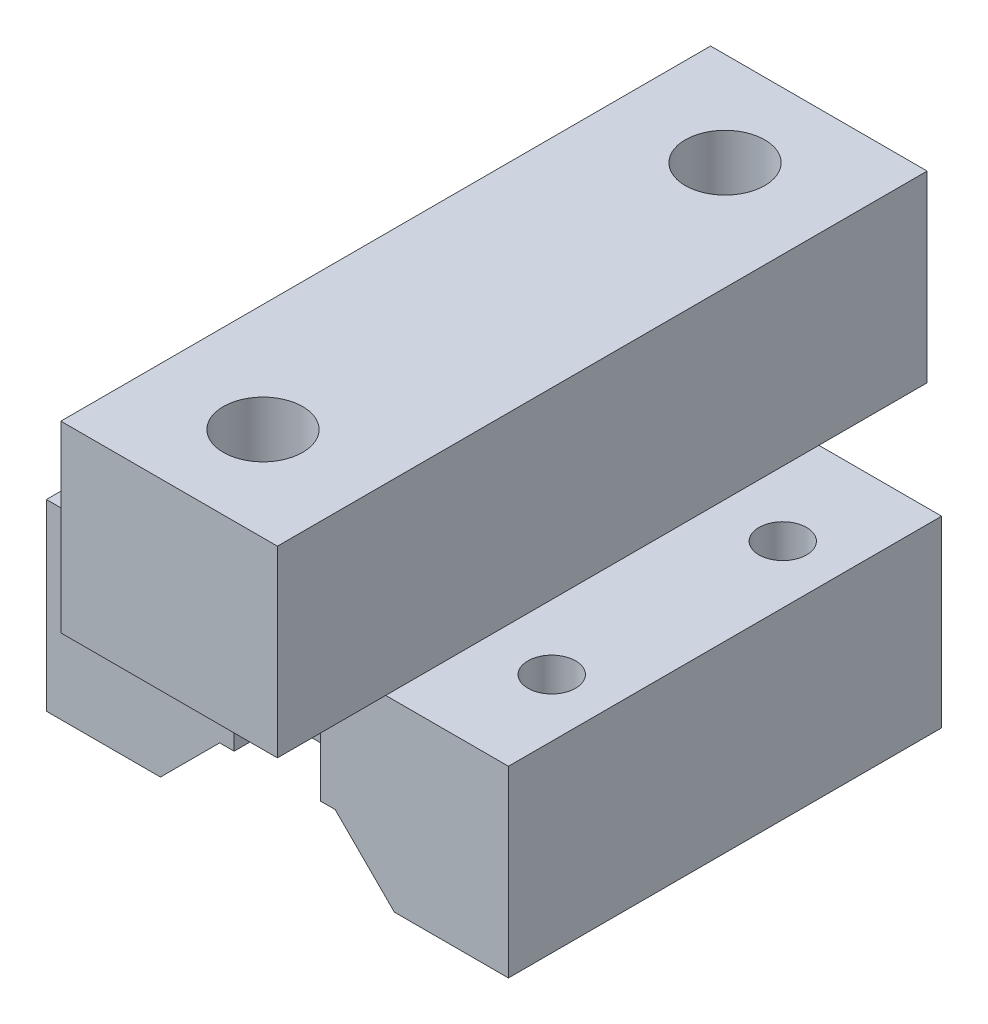
ISO-10303-21;
HEADER;
FILE_DESCRIPTION(('STEP AP214'),'2;1');
FILE_NAME('part.step','',(''),(''),'','','');
FILE_SCHEMA(('AUTOMOTIVE_DESIGN { 1 0 10303 214 1 1 1 1 }'));
ENDSEC;
DATA;
#1=APPLICATION_CONTEXT('core data for automotive mechanical design processes');
#2=APPLICATION_PROTOCOL_DEFINITION('international standard','automotive_design',2000,#1);
#3=PRODUCT_CONTEXT('',#1,'mechanical');
#4=PRODUCT('Part','Part','',(#3));
#5=PRODUCT_RELATED_PRODUCT_CATEGORY('part','',(#4));
#6=PRODUCT_DEFINITION_FORMATION('','',#4);
#7=PRODUCT_DEFINITION_CONTEXT('part definition',#1,'design');
#8=PRODUCT_DEFINITION('design','',#6,#7);
#9=PRODUCT_DEFINITION_SHAPE('','',#8);
#10=(LENGTH_UNIT() NAMED_UNIT(*) SI_UNIT(.MILLI.,.METRE.));
#11=(NAMED_UNIT(*) PLANE_ANGLE_UNIT() SI_UNIT($,.RADIAN.));
#12=(NAMED_UNIT(*) SI_UNIT($,.STERADIAN.) SOLID_ANGLE_UNIT());
#13=UNCERTAINTY_MEASURE_WITH_UNIT(LENGTH_MEASURE(1.E-05),#10,'distance_accuracy_value','');
#14=(GEOMETRIC_REPRESENTATION_CONTEXT(3) GLOBAL_UNCERTAINTY_ASSIGNED_CONTEXT((#13)) GLOBAL_UNIT_ASSIGNED_CONTEXT((#10,
#11,#12)) REPRESENTATION_CONTEXT('',''));
#15=CARTESIAN_POINT('',(0.,0.,0.));
#16=DIRECTION('',(0.,0.,1.));
#17=DIRECTION('',(1.,0.,0.));
#18=AXIS2_PLACEMENT_3D('',#15,#16,#17);
#19=CARTESIAN_POINT('',(-4.,4.10121933088198,15.));
#20=DIRECTION('',(0.,1.,0.));
#21=DIRECTION('',(0.,0.,1.));
#22=AXIS2_PLACEMENT_3D('',#19,#20,#21);
#23=PLANE('',#22);
#24=DIRECTION('',(0.,0.,-1.));
#25=VECTOR('',#24,1.);
#26=CARTESIAN_POINT('',(3.,4.10121933088198,0.));
#27=LINE('',#26,#25);
#28=CARTESIAN_POINT('',(3.,4.10121933088198,15.));
#29=VERTEX_POINT('',#28);
#30=CARTESIAN_POINT('',(3.,4.10121933088198,11.5));
#31=VERTEX_POINT('',#30);
#32=EDGE_CURVE('E253',#29,#31,#27,.T.);
#33=ORIENTED_EDGE('',*,*,#32,.T.);
#34=DIRECTION('',(1.,0.,0.));
#35=VECTOR('',#34,1.);
#36=CARTESIAN_POINT('',(0.,4.10121933088198,11.5));
#37=LINE('',#36,#35);
#38=CARTESIAN_POINT('',(-3.,4.10121933088198,11.5));
#39=VERTEX_POINT('',#38);
#40=EDGE_CURVE('E231',#39,#31,#37,.T.);
#41=ORIENTED_EDGE('',*,*,#40,.F.);
#42=DIRECTION('',(0.,0.,-1.));
#43=VECTOR('',#42,1.);
#44=CARTESIAN_POINT('',(-3.,4.10121933088198,0.));
#45=LINE('',#44,#43);
#46=CARTESIAN_POINT('',(-3.,4.10121933088198,15.));
#47=VERTEX_POINT('',#46);
#48=EDGE_CURVE('E276',#47,#39,#45,.T.);
#49=ORIENTED_EDGE('',*,*,#48,.F.);
#50=DIRECTION('',(1.,0.,0.));
#51=VECTOR('',#50,1.);
#52=CARTESIAN_POINT('',(-4.,4.10121933088198,15.));
#53=LINE('',#52,#51);
#54=CARTESIAN_POINT('',(-4.,4.10121933088198,15.));
#55=VERTEX_POINT('',#54);
#56=EDGE_CURVE('E369',#55,#47,#53,.T.);
#57=ORIENTED_EDGE('',*,*,#56,.F.);
#58=DIRECTION('',(0.,0.,-1.));
#59=VECTOR('',#58,1.);
#60=CARTESIAN_POINT('',(-4.,4.10121933088198,15.));
#61=LINE('',#60,#59);
#62=CARTESIAN_POINT('',(-4.,4.10121933088198,-15.));
#63=VERTEX_POINT('',#62);
#64=EDGE_CURVE('E395',#55,#63,#61,.T.);
#65=ORIENTED_EDGE('',*,*,#64,.T.);
#66=DIRECTION('',(1.,0.,0.));
#67=VECTOR('',#66,1.);
#68=CARTESIAN_POINT('',(-4.,4.10121933088198,-15.));
#69=LINE('',#68,#67);
#70=CARTESIAN_POINT('',(-3.,4.10121933088198,-15.));
#71=VERTEX_POINT('',#70);
#72=EDGE_CURVE('E354',#63,#71,#69,.T.);
#73=ORIENTED_EDGE('',*,*,#72,.T.);
#74=DIRECTION('',(0.,0.,1.));
#75=VECTOR('',#74,1.);
#76=CARTESIAN_POINT('',(-2.99999999999999,4.10121933088198,0.));
#77=LINE('',#76,#75);
#78=CARTESIAN_POINT('',(-3.,4.10121933088198,-11.5));
#79=VERTEX_POINT('',#78);
#80=EDGE_CURVE('E245',#71,#79,#77,.T.);
#81=ORIENTED_EDGE('',*,*,#80,.T.);
#82=DIRECTION('',(1.,0.,0.));
#83=VECTOR('',#82,1.);
#84=CARTESIAN_POINT('',(0.,4.10121933088198,-11.5));
#85=LINE('',#84,#83);
#86=CARTESIAN_POINT('',(3.,4.10121933088198,-11.5));
#87=VERTEX_POINT('',#86);
#88=EDGE_CURVE('E255',#79,#87,#85,.T.);
#89=ORIENTED_EDGE('',*,*,#88,.T.);
#90=DIRECTION('',(0.,0.,1.));
#91=VECTOR('',#90,1.);
#92=CARTESIAN_POINT('',(3.00000000000001,4.10121933088198,0.));
#93=LINE('',#92,#91);
#94=CARTESIAN_POINT('',(2.99999999999999,4.10121933088198,-15.));
#95=VERTEX_POINT('',#94);
#96=EDGE_CURVE('E260',#95,#87,#93,.T.);
#97=ORIENTED_EDGE('',*,*,#96,.F.);
#98=CARTESIAN_POINT('',(4.,4.10121933088198,-15.));
#99=VERTEX_POINT('',#98);
#100=EDGE_CURVE('E390',#95,#99,#69,.T.);
#101=ORIENTED_EDGE('',*,*,#100,.T.);
#102=DIRECTION('',(0.,0.,-1.));
#103=VECTOR('',#102,1.);
#104=CARTESIAN_POINT('',(4.,4.10121933088198,15.));
#105=LINE('',#104,#103);
#106=CARTESIAN_POINT('',(4.,4.10121933088198,15.));
#107=VERTEX_POINT('',#106);
#108=EDGE_CURVE('E372',#107,#99,#105,.T.);
#109=ORIENTED_EDGE('',*,*,#108,.F.);
#110=EDGE_CURVE('E368',#29,#107,#53,.T.);
#111=ORIENTED_EDGE('',*,*,#110,.F.);
#112=EDGE_LOOP('',(#33,#41,#49,#57,#65,#73,#81,#89,#97,#101,#109,#111));
#113=FACE_BOUND('',#112,.T.);
#114=ADVANCED_FACE('F68',(#113),#23,.F.);
#115=CARTESIAN_POINT('',(0.,0.,15.));
#116=DIRECTION('',(0.,0.,-1.));
#117=DIRECTION('',(-1.,0.,0.));
#118=AXIS2_PLACEMENT_3D('',#115,#116,#117);
#119=PLANE('',#118);
#120=DIRECTION('',(0.,1.,0.));
#121=VECTOR('',#120,1.);
#122=CARTESIAN_POINT('',(3.,0.,15.));
#123=LINE('',#122,#121);
#124=CARTESIAN_POINT('',(3.,12.7,15.));
#125=VERTEX_POINT('',#124);
#126=EDGE_CURVE('E241',#29,#125,#123,.T.);
#127=ORIENTED_EDGE('',*,*,#126,.F.);
#128=ORIENTED_EDGE('',*,*,#110,.T.);
#129=DIRECTION('',(0.707106781186546,-0.707106781186549,0.));
#130=VECTOR('',#129,1.);
#131=CARTESIAN_POINT('',(4.,4.10121933088198,15.));
#132=LINE('',#131,#130);
#133=CARTESIAN_POINT('',(8.10121933088197,0.,15.));
#134=VERTEX_POINT('',#133);
#135=EDGE_CURVE('E350',#107,#134,#132,.T.);
#136=ORIENTED_EDGE('',*,*,#135,.T.);
#137=DIRECTION('',(1.,0.,0.));
#138=VECTOR('',#137,1.);
#139=CARTESIAN_POINT('',(8.10121933088197,0.,15.));
#140=LINE('',#139,#138);
#141=CARTESIAN_POINT('',(16.,0.,15.));
#142=VERTEX_POINT('',#141);
#143=EDGE_CURVE('E353',#134,#142,#140,.T.);
#144=ORIENTED_EDGE('',*,*,#143,.T.);
#145=DIRECTION('',(0.,1.,0.));
#146=VECTOR('',#145,1.);
#147=CARTESIAN_POINT('',(16.,0.,15.));
#148=LINE('',#147,#146);
#149=CARTESIAN_POINT('',(16.,12.7,15.));
#150=VERTEX_POINT('',#149);
#151=EDGE_CURVE('E356',#142,#150,#148,.T.);
#152=ORIENTED_EDGE('',*,*,#151,.T.);
#153=DIRECTION('',(-1.,0.,0.));
#154=VECTOR('',#153,1.);
#155=CARTESIAN_POINT('',(16.,12.7,15.));
#156=LINE('',#155,#154);
#157=CARTESIAN_POINT('',(7.49999999999999,12.7,15.));
#158=VERTEX_POINT('',#157);
#159=EDGE_CURVE('E359',#150,#158,#156,.T.);
#160=ORIENTED_EDGE('',*,*,#159,.T.);
#161=EDGE_CURVE('E362',#158,#125,#156,.T.);
#162=ORIENTED_EDGE('',*,*,#161,.T.);
#163=EDGE_LOOP('',(#127,#128,#136,#144,#152,#160,#162));
#164=FACE_BOUND('',#163,.T.);
#165=ADVANCED_FACE('F433',(#164),#119,.F.);
#166=CARTESIAN_POINT('',(0.,0.,-15.));
#167=DIRECTION('',(0.,0.,-1.));
#168=DIRECTION('',(-1.,0.,0.));
#169=AXIS2_PLACEMENT_3D('',#166,#167,#168);
#170=PLANE('',#169);
#171=DIRECTION('',(-1.,0.,0.));
#172=VECTOR('',#171,1.);
#173=CARTESIAN_POINT('',(16.,12.7,-15.));
#174=LINE('',#173,#172);
#175=CARTESIAN_POINT('',(-3.,12.7,-15.));
#176=VERTEX_POINT('',#175);
#177=CARTESIAN_POINT('',(-7.50000000000001,12.7,-15.));
#178=VERTEX_POINT('',#177);
#179=EDGE_CURVE('E384',#176,#178,#174,.T.);
#180=ORIENTED_EDGE('',*,*,#179,.F.);
#181=DIRECTION('',(0.,-1.,0.));
#182=VECTOR('',#181,1.);
#183=CARTESIAN_POINT('',(-3.,0.,-15.));
#184=LINE('',#183,#182);
#185=EDGE_CURVE('E280',#176,#71,#184,.T.);
#186=ORIENTED_EDGE('',*,*,#185,.T.);
#187=ORIENTED_EDGE('',*,*,#72,.F.);
#188=DIRECTION('',(0.707106781186546,0.707106781186549,0.));
#189=VECTOR('',#188,1.);
#190=CARTESIAN_POINT('',(-4.,4.10121933088198,-15.));
#191=LINE('',#190,#189);
#192=CARTESIAN_POINT('',(-8.10121933088197,0.,-15.));
#193=VERTEX_POINT('',#192);
#194=EDGE_CURVE('E388',#193,#63,#191,.T.);
#195=ORIENTED_EDGE('',*,*,#194,.F.);
#196=DIRECTION('',(1.,0.,0.));
#197=VECTOR('',#196,1.);
#198=CARTESIAN_POINT('',(-8.10121933088197,0.,-15.));
#199=LINE('',#198,#197);
#200=CARTESIAN_POINT('',(-16.,0.,-15.));
#201=VERTEX_POINT('',#200);
#202=EDGE_CURVE('E386',#201,#193,#199,.T.);
#203=ORIENTED_EDGE('',*,*,#202,.F.);
#204=DIRECTION('',(0.,-1.,0.));
#205=VECTOR('',#204,1.);
#206=CARTESIAN_POINT('',(-16.,0.,-15.));
#207=LINE('',#206,#205);
#208=CARTESIAN_POINT('',(-16.,12.7,-15.));
#209=VERTEX_POINT('',#208);
#210=EDGE_CURVE('E382',#209,#201,#207,.T.);
#211=ORIENTED_EDGE('',*,*,#210,.F.);
#212=EDGE_CURVE('E379',#178,#209,#174,.T.);
#213=ORIENTED_EDGE('',*,*,#212,.F.);
#214=EDGE_LOOP('',(#180,#186,#187,#195,#203,#211,#213));
#215=FACE_BOUND('',#214,.T.);
#216=ADVANCED_FACE('F457',(#215),#170,.T.);
#217=CARTESIAN_POINT('',(16.,12.7,15.));
#218=DIRECTION('',(0.,-1.,0.));
#219=DIRECTION('',(1.,0.,0.));
#220=AXIS2_PLACEMENT_3D('',#217,#218,#219);
#221=PLANE('',#220);
#222=CARTESIAN_POINT('',(12.,12.7,8.));
#223=DIRECTION('',(0.,1.,0.));
#224=DIRECTION('',(0.,0.,1.));
#225=AXIS2_PLACEMENT_3D('',#222,#223,#224);
#226=CIRCLE('',#225,1.65);
#227=CARTESIAN_POINT('',(12.,12.7,9.65));
#228=VERTEX_POINT('',#227);
#229=EDGE_CURVE('E326',#228,#228,#226,.T.);
#230=ORIENTED_EDGE('',*,*,#229,.F.);
#231=EDGE_LOOP('',(#230));
#232=FACE_BOUND('',#231,.T.);
#233=CARTESIAN_POINT('',(12.,12.7,-8.));
#234=DIRECTION('',(0.,1.,0.));
#235=DIRECTION('',(0.,0.,1.));
#236=AXIS2_PLACEMENT_3D('',#233,#234,#235);
#237=CIRCLE('',#236,1.65);
#238=CARTESIAN_POINT('',(12.,12.7,-6.35));
#239=VERTEX_POINT('',#238);
#240=EDGE_CURVE('E333',#239,#239,#237,.T.);
#241=ORIENTED_EDGE('',*,*,#240,.F.);
#242=EDGE_LOOP('',(#241));
#243=FACE_BOUND('',#242,.T.);
#244=DIRECTION('',(0.,0.,-1.));
#245=VECTOR('',#244,1.);
#246=CARTESIAN_POINT('',(7.49999999999999,12.7,0.));
#247=LINE('',#246,#245);
#248=CARTESIAN_POINT('',(7.49999999999999,12.7,-15.));
#249=VERTEX_POINT('',#248);
#250=EDGE_CURVE('E77',#158,#249,#247,.T.);
#251=ORIENTED_EDGE('',*,*,#250,.F.);
#252=ORIENTED_EDGE('',*,*,#159,.F.);
#253=DIRECTION('',(0.,0.,-1.));
#254=VECTOR('',#253,1.);
#255=CARTESIAN_POINT('',(16.,12.7,15.));
#256=LINE('',#255,#254);
#257=CARTESIAN_POINT('',(16.,12.7,-15.));
#258=VERTEX_POINT('',#257);
#259=EDGE_CURVE('E407',#150,#258,#256,.T.);
#260=ORIENTED_EDGE('',*,*,#259,.T.);
#261=EDGE_CURVE('E380',#258,#249,#174,.T.);
#262=ORIENTED_EDGE('',*,*,#261,.T.);
#263=EDGE_LOOP('',(#251,#252,#260,#262));
#264=FACE_BOUND('',#263,.T.);
#265=ADVANCED_FACE('F430',(#232,#243,#264),#221,.F.);
#266=CARTESIAN_POINT('',(-12.,12.7,8.));
#267=DIRECTION('',(0.,1.,0.));
#268=DIRECTION('',(0.,0.,1.));
#269=AXIS2_PLACEMENT_3D('',#266,#267,#268);
#270=CIRCLE('',#269,1.65);
#271=CARTESIAN_POINT('',(-12.,12.7,9.65));
#272=VERTEX_POINT('',#271);
#273=EDGE_CURVE('E334',#272,#272,#270,.T.);
#274=ORIENTED_EDGE('',*,*,#273,.F.);
#275=EDGE_LOOP('',(#274));
#276=FACE_BOUND('',#275,.T.);
#277=CARTESIAN_POINT('',(-12.,12.7,-8.));
#278=DIRECTION('',(0.,1.,0.));
#279=DIRECTION('',(0.,0.,1.));
#280=AXIS2_PLACEMENT_3D('',#277,#278,#279);
#281=CIRCLE('',#280,1.65);
#282=CARTESIAN_POINT('',(-12.,12.7,-6.35));
#283=VERTEX_POINT('',#282);
#284=EDGE_CURVE('E325',#283,#283,#281,.T.);
#285=ORIENTED_EDGE('',*,*,#284,.F.);
#286=EDGE_LOOP('',(#285));
#287=FACE_BOUND('',#286,.T.);
#288=CARTESIAN_POINT('',(-7.50000000000001,12.7,15.));
#289=VERTEX_POINT('',#288);
#290=CARTESIAN_POINT('',(-16.,12.7,15.));
#291=VERTEX_POINT('',#290);
#292=EDGE_CURVE('E358',#289,#291,#156,.T.);
#293=ORIENTED_EDGE('',*,*,#292,.F.);
#294=DIRECTION('',(0.,0.,-1.));
#295=VECTOR('',#294,1.);
#296=CARTESIAN_POINT('',(-7.50000000000001,12.7,0.));
#297=LINE('',#296,#295);
#298=EDGE_CURVE('E12',#289,#178,#297,.T.);
#299=ORIENTED_EDGE('',*,*,#298,.T.);
#300=ORIENTED_EDGE('',*,*,#212,.T.);
#301=DIRECTION('',(0.,0.,-1.));
#302=VECTOR('',#301,1.);
#303=CARTESIAN_POINT('',(-16.,12.7,15.));
#304=LINE('',#303,#302);
#305=EDGE_CURVE('E404',#291,#209,#304,.T.);
#306=ORIENTED_EDGE('',*,*,#305,.F.);
#307=EDGE_LOOP('',(#293,#299,#300,#306));
#308=FACE_BOUND('',#307,.T.);
#309=ADVANCED_FACE('F452',(#276,#287,#308),#221,.F.);
#310=CARTESIAN_POINT('',(4.,4.10121933088198,15.));
#311=DIRECTION('',(0.707106781186549,0.707106781186546,0.));
#312=DIRECTION('',(-0.707106781186546,0.707106781186549,0.));
#313=AXIS2_PLACEMENT_3D('',#310,#311,#312);
#314=PLANE('',#313);
#315=DIRECTION('',(0.707106781186546,-0.707106781186549,0.));
#316=VECTOR('',#315,1.);
#317=CARTESIAN_POINT('',(4.,4.10121933088198,-15.));
#318=LINE('',#317,#316);
#319=CARTESIAN_POINT('',(8.10121933088197,0.,-15.));
#320=VERTEX_POINT('',#319);
#321=EDGE_CURVE('E349',#99,#320,#318,.T.);
#322=ORIENTED_EDGE('',*,*,#321,.T.);
#323=DIRECTION('',(0.,0.,-1.));
#324=VECTOR('',#323,1.);
#325=CARTESIAN_POINT('',(8.10121933088197,0.,15.));
#326=LINE('',#325,#324);
#327=EDGE_CURVE('E72',#134,#320,#326,.T.);
#328=ORIENTED_EDGE('',*,*,#327,.F.);
#329=ORIENTED_EDGE('',*,*,#135,.F.);
#330=ORIENTED_EDGE('',*,*,#108,.T.);
#331=EDGE_LOOP('',(#322,#328,#329,#330));
#332=FACE_BOUND('',#331,.T.);
#333=ADVANCED_FACE('F70',(#332),#314,.F.);
#334=CARTESIAN_POINT('',(8.10121933088197,0.,15.));
#335=DIRECTION('',(0.,1.,0.));
#336=DIRECTION('',(-1.,0.,0.));
#337=AXIS2_PLACEMENT_3D('',#334,#335,#336);
#338=PLANE('',#337);
#339=CARTESIAN_POINT('',(12.,0.,8.));
#340=DIRECTION('',(0.,1.,0.));
#341=DIRECTION('',(-1.,0.,0.));
#342=AXIS2_PLACEMENT_3D('',#339,#340,#341);
#343=CIRCLE('',#342,1.65);
#344=CARTESIAN_POINT('',(10.35,0.,8.));
#345=VERTEX_POINT('',#344);
#346=EDGE_CURVE('E329',#345,#345,#343,.F.);
#347=ORIENTED_EDGE('',*,*,#346,.F.);
#348=EDGE_LOOP('',(#347));
#349=FACE_BOUND('',#348,.T.);
#350=CARTESIAN_POINT('',(12.,0.,-8.));
#351=DIRECTION('',(0.,1.,0.));
#352=DIRECTION('',(-1.,0.,0.));
#353=AXIS2_PLACEMENT_3D('',#350,#351,#352);
#354=CIRCLE('',#353,1.65);
#355=CARTESIAN_POINT('',(10.35,0.,-8.));
#356=VERTEX_POINT('',#355);
#357=EDGE_CURVE('E346',#356,#356,#354,.F.);
#358=ORIENTED_EDGE('',*,*,#357,.F.);
#359=EDGE_LOOP('',(#358));
#360=FACE_BOUND('',#359,.T.);
#361=DIRECTION('',(1.,0.,0.));
#362=VECTOR('',#361,1.);
#363=CARTESIAN_POINT('',(8.10121933088197,0.,-15.));
#364=LINE('',#363,#362);
#365=CARTESIAN_POINT('',(16.,0.,-15.));
#366=VERTEX_POINT('',#365);
#367=EDGE_CURVE('E375',#320,#366,#364,.T.);
#368=ORIENTED_EDGE('',*,*,#367,.T.);
#369=DIRECTION('',(0.,0.,-1.));
#370=VECTOR('',#369,1.);
#371=CARTESIAN_POINT('',(16.,0.,15.));
#372=LINE('',#371,#370);
#373=EDGE_CURVE('E409',#142,#366,#372,.T.);
#374=ORIENTED_EDGE('',*,*,#373,.F.);
#375=ORIENTED_EDGE('',*,*,#143,.F.);
#376=ORIENTED_EDGE('',*,*,#327,.T.);
#377=EDGE_LOOP('',(#368,#374,#375,#376));
#378=FACE_BOUND('',#377,.T.);
#379=ADVANCED_FACE('F418',(#349,#360,#378),#338,.F.);
#380=CARTESIAN_POINT('',(16.,0.,15.));
#381=DIRECTION('',(-1.,0.,0.));
#382=DIRECTION('',(0.,-1.,0.));
#383=AXIS2_PLACEMENT_3D('',#380,#381,#382);
#384=PLANE('',#383);
#385=DIRECTION('',(0.,1.,0.));
#386=VECTOR('',#385,1.);
#387=CARTESIAN_POINT('',(16.,0.,-15.));
#388=LINE('',#387,#386);
#389=EDGE_CURVE('E377',#366,#258,#388,.T.);
#390=ORIENTED_EDGE('',*,*,#389,.T.);
#391=ORIENTED_EDGE('',*,*,#259,.F.);
#392=ORIENTED_EDGE('',*,*,#151,.F.);
#393=ORIENTED_EDGE('',*,*,#373,.T.);
#394=EDGE_LOOP('',(#390,#391,#392,#393));
#395=FACE_BOUND('',#394,.T.);
#396=ADVANCED_FACE('F429',(#395),#384,.F.);
#397=CARTESIAN_POINT('',(-16.,0.,15.));
#398=DIRECTION('',(1.,0.,0.));
#399=DIRECTION('',(0.,1.,0.));
#400=AXIS2_PLACEMENT_3D('',#397,#398,#399);
#401=PLANE('',#400);
#402=ORIENTED_EDGE('',*,*,#210,.T.);
#403=DIRECTION('',(0.,0.,-1.));
#404=VECTOR('',#403,1.);
#405=CARTESIAN_POINT('',(-16.,0.,15.));
#406=LINE('',#405,#404);
#407=CARTESIAN_POINT('',(-16.,0.,15.));
#408=VERTEX_POINT('',#407);
#409=EDGE_CURVE('E401',#408,#201,#406,.T.);
#410=ORIENTED_EDGE('',*,*,#409,.F.);
#411=DIRECTION('',(0.,-1.,0.));
#412=VECTOR('',#411,1.);
#413=CARTESIAN_POINT('',(-16.,0.,15.));
#414=LINE('',#413,#412);
#415=EDGE_CURVE('E361',#291,#408,#414,.T.);
#416=ORIENTED_EDGE('',*,*,#415,.F.);
#417=ORIENTED_EDGE('',*,*,#305,.T.);
#418=EDGE_LOOP('',(#402,#410,#416,#417));
#419=FACE_BOUND('',#418,.T.);
#420=ADVANCED_FACE('F523',(#419),#401,.F.);
#421=CARTESIAN_POINT('',(-8.10121933088197,0.,15.));
#422=DIRECTION('',(0.,1.,0.));
#423=DIRECTION('',(-1.,0.,0.));
#424=AXIS2_PLACEMENT_3D('',#421,#422,#423);
#425=PLANE('',#424);
#426=CARTESIAN_POINT('',(-12.,0.,-8.));
#427=DIRECTION('',(0.,1.,0.));
#428=DIRECTION('',(-1.,0.,0.));
#429=AXIS2_PLACEMENT_3D('',#426,#427,#428);
#430=CIRCLE('',#429,1.65);
#431=CARTESIAN_POINT('',(-13.65,0.,-8.));
#432=VERTEX_POINT('',#431);
#433=EDGE_CURVE('E337',#432,#432,#430,.F.);
#434=ORIENTED_EDGE('',*,*,#433,.F.);
#435=EDGE_LOOP('',(#434));
#436=FACE_BOUND('',#435,.T.);
#437=CARTESIAN_POINT('',(-12.,0.,8.));
#438=DIRECTION('',(0.,1.,0.));
#439=DIRECTION('',(-1.,0.,0.));
#440=AXIS2_PLACEMENT_3D('',#437,#438,#439);
#441=CIRCLE('',#440,1.65);
#442=CARTESIAN_POINT('',(-13.65,0.,8.));
#443=VERTEX_POINT('',#442);
#444=EDGE_CURVE('E330',#443,#443,#441,.F.);
#445=ORIENTED_EDGE('',*,*,#444,.F.);
#446=EDGE_LOOP('',(#445));
#447=FACE_BOUND('',#446,.T.);
#448=ORIENTED_EDGE('',*,*,#202,.T.);
#449=DIRECTION('',(0.,0.,-1.));
#450=VECTOR('',#449,1.);
#451=CARTESIAN_POINT('',(-8.10121933088197,0.,15.));
#452=LINE('',#451,#450);
#453=CARTESIAN_POINT('',(-8.10121933088197,0.,15.));
#454=VERTEX_POINT('',#453);
#455=EDGE_CURVE('E398',#454,#193,#452,.T.);
#456=ORIENTED_EDGE('',*,*,#455,.F.);
#457=DIRECTION('',(1.,0.,0.));
#458=VECTOR('',#457,1.);
#459=CARTESIAN_POINT('',(-8.10121933088197,0.,15.));
#460=LINE('',#459,#458);
#461=EDGE_CURVE('E364',#408,#454,#460,.T.);
#462=ORIENTED_EDGE('',*,*,#461,.F.);
#463=ORIENTED_EDGE('',*,*,#409,.T.);
#464=EDGE_LOOP('',(#448,#456,#462,#463));
#465=FACE_BOUND('',#464,.T.);
#466=ADVANCED_FACE('F519',(#436,#447,#465),#425,.F.);
#467=CARTESIAN_POINT('',(-4.,4.10121933088198,15.));
#468=DIRECTION('',(-0.707106781186549,0.707106781186546,0.));
#469=DIRECTION('',(-0.707106781186546,-0.707106781186549,0.));
#470=AXIS2_PLACEMENT_3D('',#467,#468,#469);
#471=PLANE('',#470);
#472=ORIENTED_EDGE('',*,*,#194,.T.);
#473=ORIENTED_EDGE('',*,*,#64,.F.);
#474=DIRECTION('',(0.707106781186546,0.707106781186549,0.));
#475=VECTOR('',#474,1.);
#476=CARTESIAN_POINT('',(-4.,4.10121933088198,15.));
#477=LINE('',#476,#475);
#478=EDGE_CURVE('E366',#454,#55,#477,.T.);
#479=ORIENTED_EDGE('',*,*,#478,.F.);
#480=ORIENTED_EDGE('',*,*,#455,.T.);
#481=EDGE_LOOP('',(#472,#473,#479,#480));
#482=FACE_BOUND('',#481,.T.);
#483=ADVANCED_FACE('F516',(#482),#471,.F.);
#484=ORIENTED_EDGE('',*,*,#56,.T.);
#485=DIRECTION('',(0.,1.,0.));
#486=VECTOR('',#485,1.);
#487=CARTESIAN_POINT('',(-3.,0.,15.));
#488=LINE('',#487,#486);
#489=CARTESIAN_POINT('',(-3.,12.7,15.));
#490=VERTEX_POINT('',#489);
#491=EDGE_CURVE('E274',#47,#490,#488,.T.);
#492=ORIENTED_EDGE('',*,*,#491,.T.);
#493=EDGE_CURVE('E87',#490,#289,#156,.T.);
#494=ORIENTED_EDGE('',*,*,#493,.T.);
#495=ORIENTED_EDGE('',*,*,#292,.T.);
#496=ORIENTED_EDGE('',*,*,#415,.T.);
#497=ORIENTED_EDGE('',*,*,#461,.T.);
#498=ORIENTED_EDGE('',*,*,#478,.T.);
#499=EDGE_LOOP('',(#484,#492,#494,#495,#496,#497,#498));
#500=FACE_BOUND('',#499,.T.);
#501=ADVANCED_FACE('F513',(#500),#119,.F.);
#502=DIRECTION('',(0.,-1.,0.));
#503=VECTOR('',#502,1.);
#504=CARTESIAN_POINT('',(2.99999999999999,0.,-15.));
#505=LINE('',#504,#503);
#506=CARTESIAN_POINT('',(2.99999999999999,12.7,-15.));
#507=VERTEX_POINT('',#506);
#508=EDGE_CURVE('E278',#507,#95,#505,.T.);
#509=ORIENTED_EDGE('',*,*,#508,.F.);
#510=EDGE_CURVE('E383',#249,#507,#174,.T.);
#511=ORIENTED_EDGE('',*,*,#510,.F.);
#512=ORIENTED_EDGE('',*,*,#261,.F.);
#513=ORIENTED_EDGE('',*,*,#389,.F.);
#514=ORIENTED_EDGE('',*,*,#367,.F.);
#515=ORIENTED_EDGE('',*,*,#321,.F.);
#516=ORIENTED_EDGE('',*,*,#100,.F.);
#517=EDGE_LOOP('',(#509,#511,#512,#513,#514,#515,#516));
#518=FACE_BOUND('',#517,.T.);
#519=ADVANCED_FACE('F426',(#518),#170,.T.);
#520=CARTESIAN_POINT('',(-12.,-4.66690475583122,8.));
#521=DIRECTION('',(0.,1.,0.));
#522=DIRECTION('',(0.,0.,1.));
#523=AXIS2_PLACEMENT_3D('',#520,#521,#522);
#524=CYLINDRICAL_SURFACE('',#523,1.65);
#525=ORIENTED_EDGE('',*,*,#444,.T.);
#526=EDGE_LOOP('',(#525));
#527=FACE_BOUND('',#526,.T.);
#528=ORIENTED_EDGE('',*,*,#273,.T.);
#529=EDGE_LOOP('',(#528));
#530=FACE_BOUND('',#529,.T.);
#531=ADVANCED_FACE('F550',(#527,#530),#524,.F.);
#532=CARTESIAN_POINT('',(-12.,-4.66690475583122,-8.));
#533=DIRECTION('',(0.,1.,0.));
#534=DIRECTION('',(0.,0.,1.));
#535=AXIS2_PLACEMENT_3D('',#532,#533,#534);
#536=CYLINDRICAL_SURFACE('',#535,1.65);
#537=ORIENTED_EDGE('',*,*,#433,.T.);
#538=EDGE_LOOP('',(#537));
#539=FACE_BOUND('',#538,.T.);
#540=ORIENTED_EDGE('',*,*,#284,.T.);
#541=EDGE_LOOP('',(#540));
#542=FACE_BOUND('',#541,.T.);
#543=ADVANCED_FACE('F543',(#539,#542),#536,.F.);
#544=CARTESIAN_POINT('',(12.,-4.66690475583122,-8.));
#545=DIRECTION('',(0.,1.,0.));
#546=DIRECTION('',(0.,0.,1.));
#547=AXIS2_PLACEMENT_3D('',#544,#545,#546);
#548=CYLINDRICAL_SURFACE('',#547,1.65);
#549=ORIENTED_EDGE('',*,*,#357,.T.);
#550=EDGE_LOOP('',(#549));
#551=FACE_BOUND('',#550,.T.);
#552=ORIENTED_EDGE('',*,*,#240,.T.);
#553=EDGE_LOOP('',(#552));
#554=FACE_BOUND('',#553,.T.);
#555=ADVANCED_FACE('F503',(#551,#554),#548,.F.);
#556=CARTESIAN_POINT('',(12.,-4.66690475583122,8.));
#557=DIRECTION('',(0.,1.,0.));
#558=DIRECTION('',(0.,0.,1.));
#559=AXIS2_PLACEMENT_3D('',#556,#557,#558);
#560=CYLINDRICAL_SURFACE('',#559,1.65);
#561=ORIENTED_EDGE('',*,*,#346,.T.);
#562=EDGE_LOOP('',(#561));
#563=FACE_BOUND('',#562,.T.);
#564=ORIENTED_EDGE('',*,*,#229,.T.);
#565=EDGE_LOOP('',(#564));
#566=FACE_BOUND('',#565,.T.);
#567=ADVANCED_FACE('F496',(#563,#566),#560,.F.);
#568=CARTESIAN_POINT('',(0.,12.7,0.));
#569=DIRECTION('',(0.,1.,0.));
#570=DIRECTION('',(0.,0.,1.));
#571=AXIS2_PLACEMENT_3D('',#568,#569,#570);
#572=PLANE('',#571);
#573=DIRECTION('',(0.,0.,-1.));
#574=VECTOR('',#573,1.);
#575=CARTESIAN_POINT('',(-2.99999999999999,12.7,0.));
#576=LINE('',#575,#574);
#577=CARTESIAN_POINT('',(-3.,12.7,-11.5));
#578=VERTEX_POINT('',#577);
#579=EDGE_CURVE('E258',#578,#176,#576,.T.);
#580=ORIENTED_EDGE('',*,*,#579,.T.);
#581=ORIENTED_EDGE('',*,*,#179,.T.);
#582=CARTESIAN_POINT('',(-7.50000000000001,12.7,-22.5));
#583=VERTEX_POINT('',#582);
#584=EDGE_CURVE('E80',#178,#583,#297,.T.);
#585=ORIENTED_EDGE('',*,*,#584,.T.);
#586=DIRECTION('',(-1.,0.,0.));
#587=VECTOR('',#586,1.);
#588=CARTESIAN_POINT('',(0.,12.7,-22.5));
#589=LINE('',#588,#587);
#590=CARTESIAN_POINT('',(7.49999999999999,12.7,-22.5));
#591=VERTEX_POINT('',#590);
#592=EDGE_CURVE('E308',#591,#583,#589,.T.);
#593=ORIENTED_EDGE('',*,*,#592,.F.);
#594=EDGE_CURVE('E304',#249,#591,#247,.T.);
#595=ORIENTED_EDGE('',*,*,#594,.F.);
#596=ORIENTED_EDGE('',*,*,#510,.T.);
#597=DIRECTION('',(0.,0.,-1.));
#598=VECTOR('',#597,1.);
#599=CARTESIAN_POINT('',(3.00000000000001,12.7,0.));
#600=LINE('',#599,#598);
#601=CARTESIAN_POINT('',(3.,12.7,-11.5));
#602=VERTEX_POINT('',#601);
#603=EDGE_CURVE('E262',#602,#507,#600,.T.);
#604=ORIENTED_EDGE('',*,*,#603,.F.);
#605=DIRECTION('',(-1.,0.,0.));
#606=VECTOR('',#605,1.);
#607=CARTESIAN_POINT('',(0.,12.7,-11.5));
#608=LINE('',#607,#606);
#609=EDGE_CURVE('E268',#602,#578,#608,.T.);
#610=ORIENTED_EDGE('',*,*,#609,.T.);
#611=EDGE_LOOP('',(#580,#581,#585,#593,#595,#596,#604,#610));
#612=FACE_BOUND('',#611,.T.);
#613=CARTESIAN_POINT('',(0.,12.7,-16.));
#614=DIRECTION('',(0.,1.,0.));
#615=DIRECTION('',(0.,0.,1.));
#616=AXIS2_PLACEMENT_3D('',#613,#614,#615);
#617=CIRCLE('',#616,2.75);
#618=CARTESIAN_POINT('',(0.,12.7,-13.25));
#619=VERTEX_POINT('',#618);
#620=EDGE_CURVE('E312',#619,#619,#617,.F.);
#621=ORIENTED_EDGE('',*,*,#620,.F.);
#622=EDGE_LOOP('',(#621));
#623=FACE_BOUND('',#622,.T.);
#624=ADVANCED_FACE('F462',(#612,#623),#572,.F.);
#625=CARTESIAN_POINT('',(-7.50000000000001,25.4,0.));
#626=DIRECTION('',(-1.,0.,0.));
#627=DIRECTION('',(0.,0.,1.));
#628=AXIS2_PLACEMENT_3D('',#625,#626,#627);
#629=PLANE('',#628);
#630=CARTESIAN_POINT('',(-7.5,12.7,22.5));
#631=VERTEX_POINT('',#630);
#632=EDGE_CURVE('E79',#631,#289,#297,.T.);
#633=ORIENTED_EDGE('',*,*,#632,.F.);
#634=DIRECTION('',(0.,-1.,0.));
#635=VECTOR('',#634,1.);
#636=CARTESIAN_POINT('',(-7.5,25.4,22.5));
#637=LINE('',#636,#635);
#638=CARTESIAN_POINT('',(-7.5,25.4,22.5));
#639=VERTEX_POINT('',#638);
#640=EDGE_CURVE('E322',#639,#631,#637,.T.);
#641=ORIENTED_EDGE('',*,*,#640,.F.);
#642=DIRECTION('',(0.,0.,-1.));
#643=VECTOR('',#642,1.);
#644=CARTESIAN_POINT('',(-7.50000000000001,25.4,0.));
#645=LINE('',#644,#643);
#646=CARTESIAN_POINT('',(-7.50000000000001,25.4,-22.5));
#647=VERTEX_POINT('',#646);
#648=EDGE_CURVE('E283',#639,#647,#645,.T.);
#649=ORIENTED_EDGE('',*,*,#648,.T.);
#650=DIRECTION('',(0.,-1.,0.));
#651=VECTOR('',#650,1.);
#652=CARTESIAN_POINT('',(-7.50000000000001,25.4,-22.5));
#653=LINE('',#652,#651);
#654=EDGE_CURVE('E299',#647,#583,#653,.T.);
#655=ORIENTED_EDGE('',*,*,#654,.T.);
#656=ORIENTED_EDGE('',*,*,#584,.F.);
#657=ORIENTED_EDGE('',*,*,#298,.F.);
#658=EDGE_LOOP('',(#633,#641,#649,#655,#656,#657));
#659=FACE_BOUND('',#658,.T.);
#660=ADVANCED_FACE('F446',(#659),#629,.T.);
#661=CARTESIAN_POINT('',(0.,25.4,22.5));
#662=DIRECTION('',(0.,0.,1.));
#663=DIRECTION('',(1.,0.,0.));
#664=AXIS2_PLACEMENT_3D('',#661,#662,#663);
#665=PLANE('',#664);
#666=DIRECTION('',(-1.,0.,0.));
#667=VECTOR('',#666,1.);
#668=CARTESIAN_POINT('',(0.,12.7,22.5));
#669=LINE('',#668,#667);
#670=CARTESIAN_POINT('',(7.5,12.7,22.5));
#671=VERTEX_POINT('',#670);
#672=EDGE_CURVE('E302',#671,#631,#669,.T.);
#673=ORIENTED_EDGE('',*,*,#672,.F.);
#674=DIRECTION('',(0.,-1.,0.));
#675=VECTOR('',#674,1.);
#676=CARTESIAN_POINT('',(7.5,25.4,22.5));
#677=LINE('',#676,#675);
#678=CARTESIAN_POINT('',(7.5,25.4,22.5));
#679=VERTEX_POINT('',#678);
#680=EDGE_CURVE('E320',#679,#671,#677,.T.);
#681=ORIENTED_EDGE('',*,*,#680,.F.);
#682=DIRECTION('',(-1.,0.,0.));
#683=VECTOR('',#682,1.);
#684=CARTESIAN_POINT('',(0.,25.4,22.5));
#685=LINE('',#684,#683);
#686=EDGE_CURVE('E286',#679,#639,#685,.T.);
#687=ORIENTED_EDGE('',*,*,#686,.T.);
#688=ORIENTED_EDGE('',*,*,#640,.T.);
#689=EDGE_LOOP('',(#673,#681,#687,#688));
#690=FACE_BOUND('',#689,.T.);
#691=ADVANCED_FACE('F442',(#690),#665,.T.);
#692=CARTESIAN_POINT('',(7.49999999999999,25.4,0.));
#693=DIRECTION('',(-1.,0.,0.));
#694=DIRECTION('',(0.,0.,1.));
#695=AXIS2_PLACEMENT_3D('',#692,#693,#694);
#696=PLANE('',#695);
#697=EDGE_CURVE('E305',#671,#158,#247,.T.);
#698=ORIENTED_EDGE('',*,*,#697,.T.);
#699=ORIENTED_EDGE('',*,*,#250,.T.);
#700=ORIENTED_EDGE('',*,*,#594,.T.);
#701=DIRECTION('',(0.,-1.,0.));
#702=VECTOR('',#701,1.);
#703=CARTESIAN_POINT('',(7.49999999999999,25.4,-22.5));
#704=LINE('',#703,#702);
#705=CARTESIAN_POINT('',(7.49999999999999,25.4,-22.5));
#706=VERTEX_POINT('',#705);
#707=EDGE_CURVE('E317',#706,#591,#704,.T.);
#708=ORIENTED_EDGE('',*,*,#707,.F.);
#709=DIRECTION('',(0.,0.,-1.));
#710=VECTOR('',#709,1.);
#711=CARTESIAN_POINT('',(7.49999999999999,25.4,0.));
#712=LINE('',#711,#710);
#713=EDGE_CURVE('E290',#679,#706,#712,.T.);
#714=ORIENTED_EDGE('',*,*,#713,.F.);
#715=ORIENTED_EDGE('',*,*,#680,.T.);
#716=EDGE_LOOP('',(#698,#699,#700,#708,#714,#715));
#717=FACE_BOUND('',#716,.T.);
#718=ADVANCED_FACE('F437',(#717),#696,.F.);
#719=CARTESIAN_POINT('',(0.,25.4,16.));
#720=DIRECTION('',(0.,-1.,0.));
#721=DIRECTION('',(0.,0.,-1.));
#722=AXIS2_PLACEMENT_3D('',#719,#720,#721);
#723=CYLINDRICAL_SURFACE('',#722,2.75);
#724=CARTESIAN_POINT('',(0.,25.4,16.));
#725=DIRECTION('',(0.,1.,0.));
#726=DIRECTION('',(0.,0.,1.));
#727=AXIS2_PLACEMENT_3D('',#724,#725,#726);
#728=CIRCLE('',#727,2.75);
#729=CARTESIAN_POINT('',(0.,25.4,18.75));
#730=VERTEX_POINT('',#729);
#731=EDGE_CURVE('E294',#730,#730,#728,.T.);
#732=ORIENTED_EDGE('',*,*,#731,.T.);
#733=EDGE_LOOP('',(#732));
#734=FACE_BOUND('',#733,.T.);
#735=CARTESIAN_POINT('',(0.,12.7,16.));
#736=DIRECTION('',(0.,1.,0.));
#737=DIRECTION('',(0.,0.,1.));
#738=AXIS2_PLACEMENT_3D('',#735,#736,#737);
#739=CIRCLE('',#738,2.75);
#740=CARTESIAN_POINT('',(0.,12.7,18.75));
#741=VERTEX_POINT('',#740);
#742=EDGE_CURVE('E287',#741,#741,#739,.T.);
#743=ORIENTED_EDGE('',*,*,#742,.F.);
#744=EDGE_LOOP('',(#743));
#745=FACE_BOUND('',#744,.T.);
#746=ADVANCED_FACE('F713',(#734,#745),#723,.F.);
#747=CARTESIAN_POINT('',(0.,25.4,-22.5));
#748=DIRECTION('',(0.,0.,1.));
#749=DIRECTION('',(1.,0.,0.));
#750=AXIS2_PLACEMENT_3D('',#747,#748,#749);
#751=PLANE('',#750);
#752=ORIENTED_EDGE('',*,*,#592,.T.);
#753=ORIENTED_EDGE('',*,*,#654,.F.);
#754=DIRECTION('',(-1.,0.,0.));
#755=VECTOR('',#754,1.);
#756=CARTESIAN_POINT('',(0.,25.4,-22.5));
#757=LINE('',#756,#755);
#758=EDGE_CURVE('E292',#706,#647,#757,.T.);
#759=ORIENTED_EDGE('',*,*,#758,.F.);
#760=ORIENTED_EDGE('',*,*,#707,.T.);
#761=EDGE_LOOP('',(#752,#753,#759,#760));
#762=FACE_BOUND('',#761,.T.);
#763=ADVANCED_FACE('F480',(#762),#751,.F.);
#764=CARTESIAN_POINT('',(0.,25.4,-16.));
#765=DIRECTION('',(0.,-1.,0.));
#766=DIRECTION('',(0.,0.,-1.));
#767=AXIS2_PLACEMENT_3D('',#764,#765,#766);
#768=CYLINDRICAL_SURFACE('',#767,2.75);
#769=CARTESIAN_POINT('',(0.,25.4,-16.));
#770=DIRECTION('',(0.,1.,0.));
#771=DIRECTION('',(0.,0.,1.));
#772=AXIS2_PLACEMENT_3D('',#769,#770,#771);
#773=CIRCLE('',#772,2.75);
#774=CARTESIAN_POINT('',(0.,25.4,-13.25));
#775=VERTEX_POINT('',#774);
#776=EDGE_CURVE('E297',#775,#775,#773,.F.);
#777=ORIENTED_EDGE('',*,*,#776,.F.);
#778=EDGE_LOOP('',(#777));
#779=FACE_BOUND('',#778,.T.);
#780=ORIENTED_EDGE('',*,*,#620,.T.);
#781=EDGE_LOOP('',(#780));
#782=FACE_BOUND('',#781,.T.);
#783=ADVANCED_FACE('F485',(#779,#782),#768,.F.);
#784=CARTESIAN_POINT('',(0.,25.4,0.));
#785=DIRECTION('',(0.,1.,0.));
#786=DIRECTION('',(0.,0.,1.));
#787=AXIS2_PLACEMENT_3D('',#784,#785,#786);
#788=PLANE('',#787);
#789=ORIENTED_EDGE('',*,*,#648,.F.);
#790=ORIENTED_EDGE('',*,*,#686,.F.);
#791=ORIENTED_EDGE('',*,*,#713,.T.);
#792=ORIENTED_EDGE('',*,*,#758,.T.);
#793=EDGE_LOOP('',(#789,#790,#791,#792));
#794=FACE_BOUND('',#793,.T.);
#795=ORIENTED_EDGE('',*,*,#731,.F.);
#796=EDGE_LOOP('',(#795));
#797=FACE_BOUND('',#796,.T.);
#798=ORIENTED_EDGE('',*,*,#776,.T.);
#799=EDGE_LOOP('',(#798));
#800=FACE_BOUND('',#799,.T.);
#801=ADVANCED_FACE('F482',(#794,#797,#800),#788,.T.);
#802=ORIENTED_EDGE('',*,*,#493,.F.);
#803=DIRECTION('',(0.,0.,1.));
#804=VECTOR('',#803,1.);
#805=CARTESIAN_POINT('',(-3.,12.7,0.));
#806=LINE('',#805,#804);
#807=CARTESIAN_POINT('',(-3.,12.7,11.5));
#808=VERTEX_POINT('',#807);
#809=EDGE_CURVE('E235',#808,#490,#806,.T.);
#810=ORIENTED_EDGE('',*,*,#809,.F.);
#811=DIRECTION('',(-1.,0.,0.));
#812=VECTOR('',#811,1.);
#813=CARTESIAN_POINT('',(0.,12.7,11.5));
#814=LINE('',#813,#812);
#815=CARTESIAN_POINT('',(3.,12.7,11.5));
#816=VERTEX_POINT('',#815);
#817=EDGE_CURVE('E228',#816,#808,#814,.T.);
#818=ORIENTED_EDGE('',*,*,#817,.F.);
#819=DIRECTION('',(0.,0.,1.));
#820=VECTOR('',#819,1.);
#821=CARTESIAN_POINT('',(3.,12.7,0.));
#822=LINE('',#821,#820);
#823=EDGE_CURVE('E238',#816,#125,#822,.T.);
#824=ORIENTED_EDGE('',*,*,#823,.T.);
#825=ORIENTED_EDGE('',*,*,#161,.F.);
#826=ORIENTED_EDGE('',*,*,#697,.F.);
#827=ORIENTED_EDGE('',*,*,#672,.T.);
#828=ORIENTED_EDGE('',*,*,#632,.T.);
#829=EDGE_LOOP('',(#802,#810,#818,#824,#825,#826,#827,#828));
#830=FACE_BOUND('',#829,.T.);
#831=ORIENTED_EDGE('',*,*,#742,.T.);
#832=EDGE_LOOP('',(#831));
#833=FACE_BOUND('',#832,.T.);
#834=ADVANCED_FACE('F247',(#830,#833),#572,.F.);
#835=CARTESIAN_POINT('',(-2.99999999999999,-8.42874475525969,0.));
#836=DIRECTION('',(1.,0.,0.));
#837=DIRECTION('',(0.,0.,-1.));
#838=AXIS2_PLACEMENT_3D('',#835,#836,#837);
#839=PLANE('',#838);
#840=ORIENTED_EDGE('',*,*,#579,.F.);
#841=DIRECTION('',(0.,1.,0.));
#842=VECTOR('',#841,1.);
#843=CARTESIAN_POINT('',(-3.,-8.42874475525969,-11.5));
#844=LINE('',#843,#842);
#845=EDGE_CURVE('E265',#79,#578,#844,.T.);
#846=ORIENTED_EDGE('',*,*,#845,.F.);
#847=ORIENTED_EDGE('',*,*,#80,.F.);
#848=ORIENTED_EDGE('',*,*,#185,.F.);
#849=EDGE_LOOP('',(#840,#846,#847,#848));
#850=FACE_BOUND('',#849,.T.);
#851=ADVANCED_FACE('F476',(#850),#839,.T.);
#852=CARTESIAN_POINT('',(0.,-8.42874475525969,-11.5));
#853=DIRECTION('',(0.,0.,-1.));
#854=DIRECTION('',(-1.,0.,0.));
#855=AXIS2_PLACEMENT_3D('',#852,#853,#854);
#856=PLANE('',#855);
#857=ORIENTED_EDGE('',*,*,#845,.T.);
#858=ORIENTED_EDGE('',*,*,#609,.F.);
#859=DIRECTION('',(0.,1.,0.));
#860=VECTOR('',#859,1.);
#861=CARTESIAN_POINT('',(3.,-8.42874475525969,-11.5));
#862=LINE('',#861,#860);
#863=EDGE_CURVE('E259',#87,#602,#862,.T.);
#864=ORIENTED_EDGE('',*,*,#863,.F.);
#865=ORIENTED_EDGE('',*,*,#88,.F.);
#866=EDGE_LOOP('',(#857,#858,#864,#865));
#867=FACE_BOUND('',#866,.T.);
#868=ADVANCED_FACE('F472',(#867),#856,.T.);
#869=CARTESIAN_POINT('',(3.00000000000001,-8.42874475525969,0.));
#870=DIRECTION('',(1.,0.,0.));
#871=DIRECTION('',(0.,0.,-1.));
#872=AXIS2_PLACEMENT_3D('',#869,#870,#871);
#873=PLANE('',#872);
#874=ORIENTED_EDGE('',*,*,#508,.T.);
#875=ORIENTED_EDGE('',*,*,#96,.T.);
#876=ORIENTED_EDGE('',*,*,#863,.T.);
#877=ORIENTED_EDGE('',*,*,#603,.T.);
#878=EDGE_LOOP('',(#874,#875,#876,#877));
#879=FACE_BOUND('',#878,.T.);
#880=ADVANCED_FACE('F467',(#879),#873,.F.);
#881=CARTESIAN_POINT('',(3.,-8.42874475525969,0.));
#882=DIRECTION('',(-1.,0.,0.));
#883=DIRECTION('',(0.,0.,1.));
#884=AXIS2_PLACEMENT_3D('',#881,#882,#883);
#885=PLANE('',#884);
#886=ORIENTED_EDGE('',*,*,#126,.T.);
#887=ORIENTED_EDGE('',*,*,#823,.F.);
#888=DIRECTION('',(0.,1.,0.));
#889=VECTOR('',#888,1.);
#890=CARTESIAN_POINT('',(3.,-8.42874475525969,11.5));
#891=LINE('',#890,#889);
#892=EDGE_CURVE('E223',#31,#816,#891,.T.);
#893=ORIENTED_EDGE('',*,*,#892,.F.);
#894=ORIENTED_EDGE('',*,*,#32,.F.);
#895=EDGE_LOOP('',(#886,#887,#893,#894));
#896=FACE_BOUND('',#895,.T.);
#897=ADVANCED_FACE('F239',(#896),#885,.T.);
#898=CARTESIAN_POINT('',(-3.,-8.42874475525969,0.));
#899=DIRECTION('',(-1.,0.,0.));
#900=DIRECTION('',(0.,0.,1.));
#901=AXIS2_PLACEMENT_3D('',#898,#899,#900);
#902=PLANE('',#901);
#903=ORIENTED_EDGE('',*,*,#48,.T.);
#904=DIRECTION('',(0.,1.,0.));
#905=VECTOR('',#904,1.);
#906=CARTESIAN_POINT('',(-3.,-8.42874475525969,11.5));
#907=LINE('',#906,#905);
#908=EDGE_CURVE('E234',#39,#808,#907,.T.);
#909=ORIENTED_EDGE('',*,*,#908,.T.);
#910=ORIENTED_EDGE('',*,*,#809,.T.);
#911=ORIENTED_EDGE('',*,*,#491,.F.);
#912=EDGE_LOOP('',(#903,#909,#910,#911));
#913=FACE_BOUND('',#912,.T.);
#914=ADVANCED_FACE('F567',(#913),#902,.F.);
#915=CARTESIAN_POINT('',(0.,-8.42874475525969,11.5));
#916=DIRECTION('',(0.,0.,-1.));
#917=DIRECTION('',(-1.,0.,0.));
#918=AXIS2_PLACEMENT_3D('',#915,#916,#917);
#919=PLANE('',#918);
#920=ORIENTED_EDGE('',*,*,#40,.T.);
#921=ORIENTED_EDGE('',*,*,#892,.T.);
#922=ORIENTED_EDGE('',*,*,#817,.T.);
#923=ORIENTED_EDGE('',*,*,#908,.F.);
#924=EDGE_LOOP('',(#920,#921,#922,#923));
#925=FACE_BOUND('',#924,.T.);
#926=ADVANCED_FACE('F225',(#925),#919,.F.);
#927=CLOSED_SHELL('',(#114,#165,#216,#265,#309,#333,#379,#396,#420,#466,#483,#501,#519,#531,
#543,#555,#567,#624,#660,#691,#718,#746,#763,#783,#801,#834,#851,#868,#880,#897,#914,#926));
#928=MANIFOLD_SOLID_BREP('B2',#927);
#929=ADVANCED_BREP_SHAPE_REPRESENTATION('',(#18,#928),#14);
#930=SHAPE_DEFINITION_REPRESENTATION(#9,#929);
ENDSEC;
END-ISO-10303-21;
